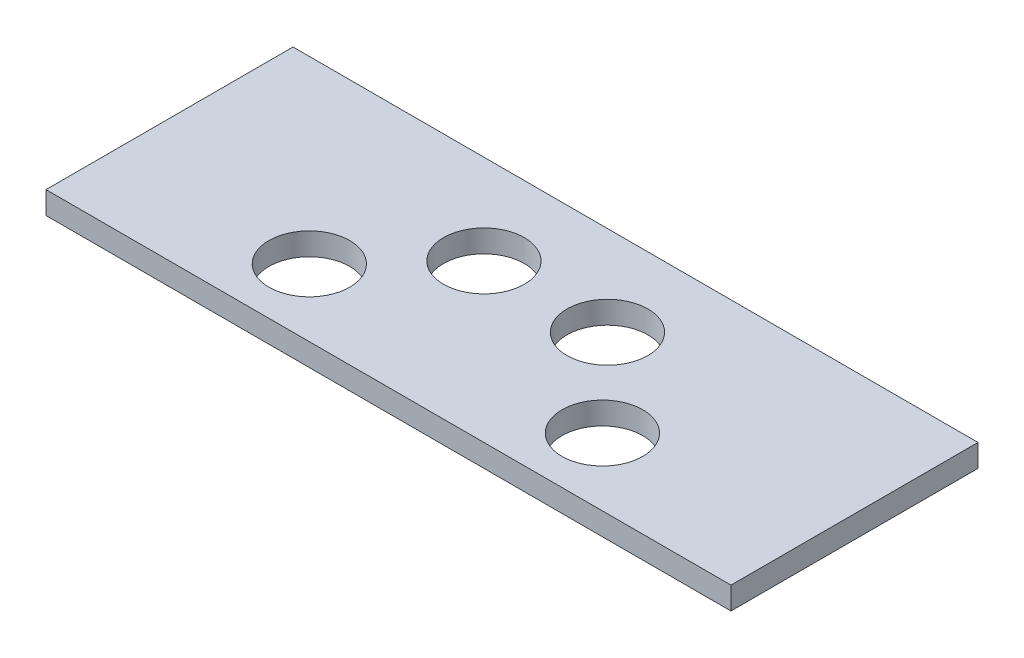
ISO-10303-21;
HEADER;
FILE_DESCRIPTION(('STEP AP214'),'2;1');
FILE_NAME('part.step','',(''),(''),'','','');
FILE_SCHEMA(('AUTOMOTIVE_DESIGN { 1 0 10303 214 1 1 1 1 }'));
ENDSEC;
DATA;
#1=APPLICATION_CONTEXT('core data for automotive mechanical design processes');
#2=APPLICATION_PROTOCOL_DEFINITION('international standard','automotive_design',2000,#1);
#3=PRODUCT_CONTEXT('',#1,'mechanical');
#4=PRODUCT('Part','Part','',(#3));
#5=PRODUCT_RELATED_PRODUCT_CATEGORY('part','',(#4));
#6=PRODUCT_DEFINITION_FORMATION('','',#4);
#7=PRODUCT_DEFINITION_CONTEXT('part definition',#1,'design');
#8=PRODUCT_DEFINITION('design','',#6,#7);
#9=PRODUCT_DEFINITION_SHAPE('','',#8);
#10=(LENGTH_UNIT() NAMED_UNIT(*) SI_UNIT(.MILLI.,.METRE.));
#11=(NAMED_UNIT(*) PLANE_ANGLE_UNIT() SI_UNIT($,.RADIAN.));
#12=(NAMED_UNIT(*) SI_UNIT($,.STERADIAN.) SOLID_ANGLE_UNIT());
#13=UNCERTAINTY_MEASURE_WITH_UNIT(LENGTH_MEASURE(1.E-05),#10,'distance_accuracy_value','');
#14=(GEOMETRIC_REPRESENTATION_CONTEXT(3) GLOBAL_UNCERTAINTY_ASSIGNED_CONTEXT((#13)) GLOBAL_UNIT_ASSIGNED_CONTEXT((#10,
#11,#12)) REPRESENTATION_CONTEXT('',''));
#15=CARTESIAN_POINT('',(0.,0.,0.));
#16=DIRECTION('',(0.,0.,1.));
#17=DIRECTION('',(1.,0.,0.));
#18=AXIS2_PLACEMENT_3D('',#15,#16,#17);
#19=CARTESIAN_POINT('',(0.,1.,0.));
#20=DIRECTION('',(0.,1.,0.));
#21=DIRECTION('',(0.,0.,1.));
#22=AXIS2_PLACEMENT_3D('',#19,#20,#21);
#23=PLANE('',#22);
#24=CARTESIAN_POINT('',(-9.66986652234249,1.,-0.135460251046023));
#25=DIRECTION('',(0.,1.,0.));
#26=DIRECTION('',(0.,0.,1.));
#27=AXIS2_PLACEMENT_3D('',#24,#25,#26);
#28=CIRCLE('',#27,1.8);
#29=CARTESIAN_POINT('',(-9.66986652234249,1.,1.66453974895398));
#30=VERTEX_POINT('',#29);
#31=EDGE_CURVE('E121',#30,#30,#28,.T.);
#32=ORIENTED_EDGE('',*,*,#31,.F.);
#33=EDGE_LOOP('',(#32));
#34=FACE_BOUND('',#33,.T.);
#35=CARTESIAN_POINT('',(-5.89494930470711,1.,-4.13546025104602));
#36=DIRECTION('',(0.,1.,0.));
#37=DIRECTION('',(0.,0.,1.));
#38=AXIS2_PLACEMENT_3D('',#35,#36,#37);
#39=CIRCLE('',#38,1.8);
#40=CARTESIAN_POINT('',(-5.89494930470711,1.,-2.33546025104602));
#41=VERTEX_POINT('',#40);
#42=EDGE_CURVE('E100',#41,#41,#39,.T.);
#43=ORIENTED_EDGE('',*,*,#42,.F.);
#44=EDGE_LOOP('',(#43));
#45=FACE_BOUND('',#44,.T.);
#46=DIRECTION('',(0.,0.,1.));
#47=VECTOR('',#46,1.);
#48=CARTESIAN_POINT('',(-18.3949493047071,1.,-8.13546025104602));
#49=LINE('',#48,#47);
#50=CARTESIAN_POINT('',(-18.3949493047071,1.,-8.13546025104602));
#51=VERTEX_POINT('',#50);
#52=CARTESIAN_POINT('',(-18.3949493047071,1.,2.86453974895398));
#53=VERTEX_POINT('',#52);
#54=EDGE_CURVE('E85',#51,#53,#49,.T.);
#55=ORIENTED_EDGE('',*,*,#54,.T.);
#56=DIRECTION('',(1.,0.,0.));
#57=VECTOR('',#56,1.);
#58=CARTESIAN_POINT('',(-18.3949493047071,1.,2.86453974895398));
#59=LINE('',#58,#57);
#60=CARTESIAN_POINT('',(12.1050506952929,1.,2.86453974895398));
#61=VERTEX_POINT('',#60);
#62=EDGE_CURVE('E80',#53,#61,#59,.T.);
#63=ORIENTED_EDGE('',*,*,#62,.T.);
#64=DIRECTION('',(0.,0.,-1.));
#65=VECTOR('',#64,1.);
#66=CARTESIAN_POINT('',(12.1050506952929,1.,-8.13546025104602));
#67=LINE('',#66,#65);
#68=CARTESIAN_POINT('',(12.1050506952929,1.,-8.13546025104602));
#69=VERTEX_POINT('',#68);
#70=EDGE_CURVE('E83',#61,#69,#67,.T.);
#71=ORIENTED_EDGE('',*,*,#70,.T.);
#72=DIRECTION('',(-1.,0.,0.));
#73=VECTOR('',#72,1.);
#74=CARTESIAN_POINT('',(-18.3949493047071,1.,-8.13546025104602));
#75=LINE('',#74,#73);
#76=EDGE_CURVE('E50',#69,#51,#75,.T.);
#77=ORIENTED_EDGE('',*,*,#76,.T.);
#78=EDGE_LOOP('',(#55,#63,#71,#77));
#79=FACE_BOUND('',#78,.T.);
#80=CARTESIAN_POINT('',(-0.394949304707112,1.,-4.13546025104602));
#81=DIRECTION('',(0.,1.,0.));
#82=DIRECTION('',(0.,0.,1.));
#83=AXIS2_PLACEMENT_3D('',#80,#81,#82);
#84=CIRCLE('',#83,1.8);
#85=CARTESIAN_POINT('',(-0.394949304707112,1.,-2.33546025104602));
#86=VERTEX_POINT('',#85);
#87=EDGE_CURVE('E115',#86,#86,#84,.T.);
#88=ORIENTED_EDGE('',*,*,#87,.F.);
#89=EDGE_LOOP('',(#88));
#90=FACE_BOUND('',#89,.T.);
#91=CARTESIAN_POINT('',(3.37996791292826,1.,-0.135460251046023));
#92=DIRECTION('',(0.,1.,0.));
#93=DIRECTION('',(0.,0.,1.));
#94=AXIS2_PLACEMENT_3D('',#91,#92,#93);
#95=CIRCLE('',#94,1.8);
#96=CARTESIAN_POINT('',(3.37996791292826,1.,1.66453974895398));
#97=VERTEX_POINT('',#96);
#98=EDGE_CURVE('E127',#97,#97,#95,.T.);
#99=ORIENTED_EDGE('',*,*,#98,.F.);
#100=EDGE_LOOP('',(#99));
#101=FACE_BOUND('',#100,.T.);
#102=ADVANCED_FACE('F33',(#34,#45,#79,#90,#101),#23,.T.);
#103=CARTESIAN_POINT('',(0.,0.,0.));
#104=DIRECTION('',(0.,1.,0.));
#105=DIRECTION('',(0.,0.,1.));
#106=AXIS2_PLACEMENT_3D('',#103,#104,#105);
#107=PLANE('',#106);
#108=DIRECTION('',(0.,0.,1.));
#109=VECTOR('',#108,1.);
#110=CARTESIAN_POINT('',(-18.3949493047071,0.,-8.13546025104602));
#111=LINE('',#110,#109);
#112=CARTESIAN_POINT('',(-18.3949493047071,0.,-8.13546025104602));
#113=VERTEX_POINT('',#112);
#114=CARTESIAN_POINT('',(-18.3949493047071,0.,2.86453974895398));
#115=VERTEX_POINT('',#114);
#116=EDGE_CURVE('E97',#113,#115,#111,.T.);
#117=ORIENTED_EDGE('',*,*,#116,.F.);
#118=DIRECTION('',(-1.,0.,0.));
#119=VECTOR('',#118,1.);
#120=CARTESIAN_POINT('',(-18.3949493047071,0.,-8.13546025104602));
#121=LINE('',#120,#119);
#122=CARTESIAN_POINT('',(12.1050506952929,0.,-8.13546025104602));
#123=VERTEX_POINT('',#122);
#124=EDGE_CURVE('E73',#123,#113,#121,.T.);
#125=ORIENTED_EDGE('',*,*,#124,.F.);
#126=DIRECTION('',(0.,0.,-1.));
#127=VECTOR('',#126,1.);
#128=CARTESIAN_POINT('',(12.1050506952929,0.,-8.13546025104602));
#129=LINE('',#128,#127);
#130=CARTESIAN_POINT('',(12.1050506952929,0.,2.86453974895398));
#131=VERTEX_POINT('',#130);
#132=EDGE_CURVE('E67',#131,#123,#129,.T.);
#133=ORIENTED_EDGE('',*,*,#132,.F.);
#134=DIRECTION('',(1.,0.,0.));
#135=VECTOR('',#134,1.);
#136=CARTESIAN_POINT('',(-18.3949493047071,0.,2.86453974895398));
#137=LINE('',#136,#135);
#138=EDGE_CURVE('E89',#115,#131,#137,.T.);
#139=ORIENTED_EDGE('',*,*,#138,.F.);
#140=EDGE_LOOP('',(#117,#125,#133,#139));
#141=FACE_BOUND('',#140,.T.);
#142=CARTESIAN_POINT('',(-5.89494930470711,0.,-4.13546025104602));
#143=DIRECTION('',(0.,1.,0.));
#144=DIRECTION('',(0.,0.,1.));
#145=AXIS2_PLACEMENT_3D('',#142,#143,#144);
#146=CIRCLE('',#145,1.8);
#147=CARTESIAN_POINT('',(-5.89494930470711,0.,-2.33546025104602));
#148=VERTEX_POINT('',#147);
#149=EDGE_CURVE('E112',#148,#148,#146,.T.);
#150=ORIENTED_EDGE('',*,*,#149,.T.);
#151=EDGE_LOOP('',(#150));
#152=FACE_BOUND('',#151,.T.);
#153=CARTESIAN_POINT('',(-0.394949304707112,0.,-4.13546025104602));
#154=DIRECTION('',(0.,1.,0.));
#155=DIRECTION('',(0.,0.,1.));
#156=AXIS2_PLACEMENT_3D('',#153,#154,#155);
#157=CIRCLE('',#156,1.8);
#158=CARTESIAN_POINT('',(-0.394949304707112,0.,-2.33546025104602));
#159=VERTEX_POINT('',#158);
#160=EDGE_CURVE('E118',#159,#159,#157,.T.);
#161=ORIENTED_EDGE('',*,*,#160,.T.);
#162=EDGE_LOOP('',(#161));
#163=FACE_BOUND('',#162,.T.);
#164=CARTESIAN_POINT('',(-9.66986652234249,0.,-0.135460251046023));
#165=DIRECTION('',(0.,1.,0.));
#166=DIRECTION('',(0.,0.,1.));
#167=AXIS2_PLACEMENT_3D('',#164,#165,#166);
#168=CIRCLE('',#167,1.8);
#169=CARTESIAN_POINT('',(-9.66986652234249,0.,1.66453974895398));
#170=VERTEX_POINT('',#169);
#171=EDGE_CURVE('E124',#170,#170,#168,.T.);
#172=ORIENTED_EDGE('',*,*,#171,.T.);
#173=EDGE_LOOP('',(#172));
#174=FACE_BOUND('',#173,.T.);
#175=CARTESIAN_POINT('',(3.37996791292826,0.,-0.135460251046023));
#176=DIRECTION('',(0.,1.,0.));
#177=DIRECTION('',(0.,0.,1.));
#178=AXIS2_PLACEMENT_3D('',#175,#176,#177);
#179=CIRCLE('',#178,1.8);
#180=CARTESIAN_POINT('',(3.37996791292826,0.,1.66453974895398));
#181=VERTEX_POINT('',#180);
#182=EDGE_CURVE('E130',#181,#181,#179,.T.);
#183=ORIENTED_EDGE('',*,*,#182,.T.);
#184=EDGE_LOOP('',(#183));
#185=FACE_BOUND('',#184,.T.);
#186=ADVANCED_FACE('F108',(#141,#152,#163,#174,#185),#107,.F.);
#187=CARTESIAN_POINT('',(-18.3949493047071,1.,-8.13546025104602));
#188=DIRECTION('',(1.,0.,0.));
#189=DIRECTION('',(0.,0.,-1.));
#190=AXIS2_PLACEMENT_3D('',#187,#188,#189);
#191=PLANE('',#190);
#192=ORIENTED_EDGE('',*,*,#116,.T.);
#193=DIRECTION('',(0.,-1.,0.));
#194=VECTOR('',#193,1.);
#195=CARTESIAN_POINT('',(-18.3949493047071,1.,2.86453974895398));
#196=LINE('',#195,#194);
#197=EDGE_CURVE('E11',#53,#115,#196,.T.);
#198=ORIENTED_EDGE('',*,*,#197,.F.);
#199=ORIENTED_EDGE('',*,*,#54,.F.);
#200=DIRECTION('',(0.,-1.,0.));
#201=VECTOR('',#200,1.);
#202=CARTESIAN_POINT('',(-18.3949493047071,1.,-8.13546025104602));
#203=LINE('',#202,#201);
#204=EDGE_CURVE('E93',#51,#113,#203,.T.);
#205=ORIENTED_EDGE('',*,*,#204,.T.);
#206=EDGE_LOOP('',(#192,#198,#199,#205));
#207=FACE_BOUND('',#206,.T.);
#208=ADVANCED_FACE('F35',(#207),#191,.F.);
#209=CARTESIAN_POINT('',(-18.3949493047071,1.,2.86453974895398));
#210=DIRECTION('',(0.,0.,-1.));
#211=DIRECTION('',(-1.,0.,0.));
#212=AXIS2_PLACEMENT_3D('',#209,#210,#211);
#213=PLANE('',#212);
#214=ORIENTED_EDGE('',*,*,#138,.T.);
#215=DIRECTION('',(0.,-1.,0.));
#216=VECTOR('',#215,1.);
#217=CARTESIAN_POINT('',(12.1050506952929,1.,2.86453974895398));
#218=LINE('',#217,#216);
#219=EDGE_CURVE('E42',#61,#131,#218,.T.);
#220=ORIENTED_EDGE('',*,*,#219,.F.);
#221=ORIENTED_EDGE('',*,*,#62,.F.);
#222=ORIENTED_EDGE('',*,*,#197,.T.);
#223=EDGE_LOOP('',(#214,#220,#221,#222));
#224=FACE_BOUND('',#223,.T.);
#225=ADVANCED_FACE('F88',(#224),#213,.F.);
#226=CARTESIAN_POINT('',(12.1050506952929,1.,-8.13546025104602));
#227=DIRECTION('',(-1.,0.,0.));
#228=DIRECTION('',(0.,0.,1.));
#229=AXIS2_PLACEMENT_3D('',#226,#227,#228);
#230=PLANE('',#229);
#231=ORIENTED_EDGE('',*,*,#132,.T.);
#232=DIRECTION('',(0.,-1.,0.));
#233=VECTOR('',#232,1.);
#234=CARTESIAN_POINT('',(12.1050506952929,1.,-8.13546025104602));
#235=LINE('',#234,#233);
#236=EDGE_CURVE('E90',#69,#123,#235,.T.);
#237=ORIENTED_EDGE('',*,*,#236,.F.);
#238=ORIENTED_EDGE('',*,*,#70,.F.);
#239=ORIENTED_EDGE('',*,*,#219,.T.);
#240=EDGE_LOOP('',(#231,#237,#238,#239));
#241=FACE_BOUND('',#240,.T.);
#242=ADVANCED_FACE('F91',(#241),#230,.F.);
#243=CARTESIAN_POINT('',(-18.3949493047071,1.,-8.13546025104602));
#244=DIRECTION('',(0.,0.,1.));
#245=DIRECTION('',(1.,0.,0.));
#246=AXIS2_PLACEMENT_3D('',#243,#244,#245);
#247=PLANE('',#246);
#248=ORIENTED_EDGE('',*,*,#124,.T.);
#249=ORIENTED_EDGE('',*,*,#204,.F.);
#250=ORIENTED_EDGE('',*,*,#76,.F.);
#251=ORIENTED_EDGE('',*,*,#236,.T.);
#252=EDGE_LOOP('',(#248,#249,#250,#251));
#253=FACE_BOUND('',#252,.T.);
#254=ADVANCED_FACE('F105',(#253),#247,.F.);
#255=CARTESIAN_POINT('',(-5.89494930470711,1.,-4.13546025104602));
#256=DIRECTION('',(0.,-1.,0.));
#257=DIRECTION('',(0.,0.,-1.));
#258=AXIS2_PLACEMENT_3D('',#255,#256,#257);
#259=CYLINDRICAL_SURFACE('',#258,1.8);
#260=ORIENTED_EDGE('',*,*,#42,.T.);
#261=EDGE_LOOP('',(#260));
#262=FACE_BOUND('',#261,.T.);
#263=ORIENTED_EDGE('',*,*,#149,.F.);
#264=EDGE_LOOP('',(#263));
#265=FACE_BOUND('',#264,.T.);
#266=ADVANCED_FACE('F149',(#262,#265),#259,.F.);
#267=CARTESIAN_POINT('',(-0.394949304707112,1.,-4.13546025104602));
#268=DIRECTION('',(0.,-1.,0.));
#269=DIRECTION('',(0.,0.,-1.));
#270=AXIS2_PLACEMENT_3D('',#267,#268,#269);
#271=CYLINDRICAL_SURFACE('',#270,1.8);
#272=ORIENTED_EDGE('',*,*,#87,.T.);
#273=EDGE_LOOP('',(#272));
#274=FACE_BOUND('',#273,.T.);
#275=ORIENTED_EDGE('',*,*,#160,.F.);
#276=EDGE_LOOP('',(#275));
#277=FACE_BOUND('',#276,.T.);
#278=ADVANCED_FACE('F195',(#274,#277),#271,.F.);
#279=CARTESIAN_POINT('',(-9.66986652234249,1.,-0.135460251046023));
#280=DIRECTION('',(0.,-1.,0.));
#281=DIRECTION('',(0.,0.,-1.));
#282=AXIS2_PLACEMENT_3D('',#279,#280,#281);
#283=CYLINDRICAL_SURFACE('',#282,1.8);
#284=ORIENTED_EDGE('',*,*,#31,.T.);
#285=EDGE_LOOP('',(#284));
#286=FACE_BOUND('',#285,.T.);
#287=ORIENTED_EDGE('',*,*,#171,.F.);
#288=EDGE_LOOP('',(#287));
#289=FACE_BOUND('',#288,.T.);
#290=ADVANCED_FACE('F203',(#286,#289),#283,.F.);
#291=CARTESIAN_POINT('',(3.37996791292826,1.,-0.135460251046023));
#292=DIRECTION('',(0.,-1.,0.));
#293=DIRECTION('',(0.,0.,-1.));
#294=AXIS2_PLACEMENT_3D('',#291,#292,#293);
#295=CYLINDRICAL_SURFACE('',#294,1.8);
#296=ORIENTED_EDGE('',*,*,#98,.T.);
#297=EDGE_LOOP('',(#296));
#298=FACE_BOUND('',#297,.T.);
#299=ORIENTED_EDGE('',*,*,#182,.F.);
#300=EDGE_LOOP('',(#299));
#301=FACE_BOUND('',#300,.T.);
#302=ADVANCED_FACE('F136',(#298,#301),#295,.F.);
#303=CLOSED_SHELL('',(#102,#186,#208,#225,#242,#254,#266,#278,#290,#302));
#304=MANIFOLD_SOLID_BREP('B2',#303);
#305=ADVANCED_BREP_SHAPE_REPRESENTATION('',(#18,#304),#14);
#306=SHAPE_DEFINITION_REPRESENTATION(#9,#305);
ENDSEC;
END-ISO-10303-21;
